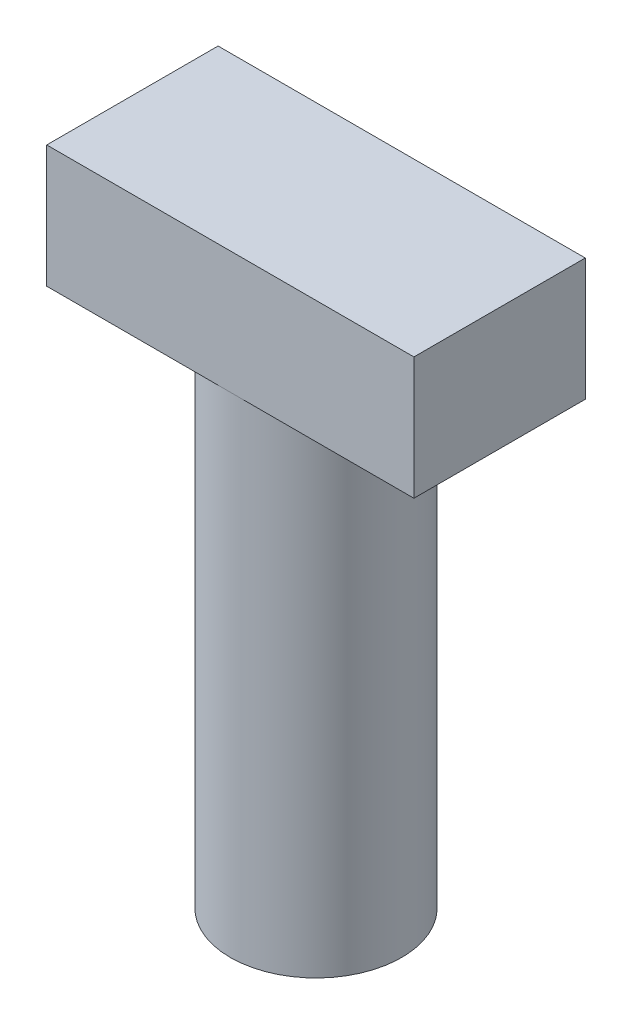
ISO-10303-21;
HEADER;
FILE_DESCRIPTION(('STEP AP214'),'2;1');
FILE_NAME('part.step','',(''),(''),'','','');
FILE_SCHEMA(('AUTOMOTIVE_DESIGN { 1 0 10303 214 1 1 1 1 }'));
ENDSEC;
DATA;
#1=APPLICATION_CONTEXT('core data for automotive mechanical design processes');
#2=APPLICATION_PROTOCOL_DEFINITION('international standard','automotive_design',2000,#1);
#3=PRODUCT_CONTEXT('',#1,'mechanical');
#4=PRODUCT('Part','Part','',(#3));
#5=PRODUCT_RELATED_PRODUCT_CATEGORY('part','',(#4));
#6=PRODUCT_DEFINITION_FORMATION('','',#4);
#7=PRODUCT_DEFINITION_CONTEXT('part definition',#1,'design');
#8=PRODUCT_DEFINITION('design','',#6,#7);
#9=PRODUCT_DEFINITION_SHAPE('','',#8);
#10=(LENGTH_UNIT() NAMED_UNIT(*) SI_UNIT(.MILLI.,.METRE.));
#11=(NAMED_UNIT(*) PLANE_ANGLE_UNIT() SI_UNIT($,.RADIAN.));
#12=(NAMED_UNIT(*) SI_UNIT($,.STERADIAN.) SOLID_ANGLE_UNIT());
#13=UNCERTAINTY_MEASURE_WITH_UNIT(LENGTH_MEASURE(1.E-05),#10,'distance_accuracy_value','');
#14=(GEOMETRIC_REPRESENTATION_CONTEXT(3) GLOBAL_UNCERTAINTY_ASSIGNED_CONTEXT((#13)) GLOBAL_UNIT_ASSIGNED_CONTEXT((#10,
#11,#12)) REPRESENTATION_CONTEXT('',''));
#15=CARTESIAN_POINT('',(0.,0.,0.));
#16=DIRECTION('',(0.,0.,1.));
#17=DIRECTION('',(1.,0.,0.));
#18=AXIS2_PLACEMENT_3D('',#15,#16,#17);
#19=CARTESIAN_POINT('',(0.,-10.,0.));
#20=DIRECTION('',(0.,1.,0.));
#21=DIRECTION('',(0.,0.,1.));
#22=AXIS2_PLACEMENT_3D('',#19,#20,#21);
#23=PLANE('',#22);
#24=CARTESIAN_POINT('',(0.,-10.,0.));
#25=DIRECTION('',(0.,-1.,0.));
#26=DIRECTION('',(0.,0.,-1.));
#27=AXIS2_PLACEMENT_3D('',#24,#25,#26);
#28=CIRCLE('',#27,7.);
#29=CARTESIAN_POINT('',(0.,-10.,-7.));
#30=VERTEX_POINT('',#29);
#31=CARTESIAN_POINT('',(0.,-10.,7.));
#32=VERTEX_POINT('',#31);
#33=EDGE_CURVE('E56',#30,#32,#28,.T.);
#34=ORIENTED_EDGE('',*,*,#33,.F.);
#35=DIRECTION('',(-1.,0.,0.));
#36=VECTOR('',#35,1.);
#37=CARTESIAN_POINT('',(-15.,-10.,-7.));
#38=LINE('',#37,#36);
#39=CARTESIAN_POINT('',(15.,-10.,-7.));
#40=VERTEX_POINT('',#39);
#41=EDGE_CURVE('E97',#40,#30,#38,.T.);
#42=ORIENTED_EDGE('',*,*,#41,.F.);
#43=DIRECTION('',(0.,0.,-1.));
#44=VECTOR('',#43,1.);
#45=CARTESIAN_POINT('',(15.,-10.,-7.));
#46=LINE('',#45,#44);
#47=CARTESIAN_POINT('',(15.,-10.,7.));
#48=VERTEX_POINT('',#47);
#49=EDGE_CURVE('E109',#48,#40,#46,.T.);
#50=ORIENTED_EDGE('',*,*,#49,.F.);
#51=DIRECTION('',(1.,0.,0.));
#52=VECTOR('',#51,1.);
#53=CARTESIAN_POINT('',(-15.,-10.,7.));
#54=LINE('',#53,#52);
#55=EDGE_CURVE('E111',#32,#48,#54,.T.);
#56=ORIENTED_EDGE('',*,*,#55,.F.);
#57=EDGE_LOOP('',(#34,#42,#50,#56));
#58=FACE_BOUND('',#57,.T.);
#59=ADVANCED_FACE('F45',(#58),#23,.F.);
#60=CARTESIAN_POINT('',(-15.,-10.,-7.));
#61=DIRECTION('',(-1.,0.,0.));
#62=DIRECTION('',(0.,0.,1.));
#63=AXIS2_PLACEMENT_3D('',#60,#61,#62);
#64=PLANE('',#63);
#65=DIRECTION('',(0.,0.,1.));
#66=VECTOR('',#65,1.);
#67=CARTESIAN_POINT('',(-15.,0.,-7.));
#68=LINE('',#67,#66);
#69=CARTESIAN_POINT('',(-15.,0.,-7.));
#70=VERTEX_POINT('',#69);
#71=CARTESIAN_POINT('',(-15.,0.,7.));
#72=VERTEX_POINT('',#71);
#73=EDGE_CURVE('E204',#70,#72,#68,.T.);
#74=ORIENTED_EDGE('',*,*,#73,.F.);
#75=DIRECTION('',(0.,1.,0.));
#76=VECTOR('',#75,1.);
#77=CARTESIAN_POINT('',(-15.,-10.,-7.));
#78=LINE('',#77,#76);
#79=CARTESIAN_POINT('',(-15.,-10.,-7.));
#80=VERTEX_POINT('',#79);
#81=EDGE_CURVE('E54',#80,#70,#78,.T.);
#82=ORIENTED_EDGE('',*,*,#81,.F.);
#83=DIRECTION('',(0.,0.,1.));
#84=VECTOR('',#83,1.);
#85=CARTESIAN_POINT('',(-15.,-10.,-7.));
#86=LINE('',#85,#84);
#87=CARTESIAN_POINT('',(-15.,-10.,7.));
#88=VERTEX_POINT('',#87);
#89=EDGE_CURVE('E108',#80,#88,#86,.T.);
#90=ORIENTED_EDGE('',*,*,#89,.T.);
#91=DIRECTION('',(0.,1.,0.));
#92=VECTOR('',#91,1.);
#93=CARTESIAN_POINT('',(-15.,-10.,7.));
#94=LINE('',#93,#92);
#95=EDGE_CURVE('E49',#88,#72,#94,.T.);
#96=ORIENTED_EDGE('',*,*,#95,.T.);
#97=EDGE_LOOP('',(#74,#82,#90,#96));
#98=FACE_BOUND('',#97,.T.);
#99=ADVANCED_FACE('F47',(#98),#64,.T.);
#100=CARTESIAN_POINT('',(-15.,-10.,-7.));
#101=DIRECTION('',(0.,0.,-1.));
#102=DIRECTION('',(-1.,0.,0.));
#103=AXIS2_PLACEMENT_3D('',#100,#101,#102);
#104=PLANE('',#103);
#105=DIRECTION('',(-1.,0.,0.));
#106=VECTOR('',#105,1.);
#107=CARTESIAN_POINT('',(-15.,0.,-7.));
#108=LINE('',#107,#106);
#109=CARTESIAN_POINT('',(15.,0.,-7.));
#110=VERTEX_POINT('',#109);
#111=EDGE_CURVE('E207',#110,#70,#108,.T.);
#112=ORIENTED_EDGE('',*,*,#111,.F.);
#113=DIRECTION('',(0.,1.,0.));
#114=VECTOR('',#113,1.);
#115=CARTESIAN_POINT('',(15.,-10.,-7.));
#116=LINE('',#115,#114);
#117=EDGE_CURVE('E99',#40,#110,#116,.T.);
#118=ORIENTED_EDGE('',*,*,#117,.F.);
#119=ORIENTED_EDGE('',*,*,#41,.T.);
#120=EDGE_CURVE('E69',#30,#80,#38,.T.);
#121=ORIENTED_EDGE('',*,*,#120,.T.);
#122=ORIENTED_EDGE('',*,*,#81,.T.);
#123=EDGE_LOOP('',(#112,#118,#119,#121,#122));
#124=FACE_BOUND('',#123,.T.);
#125=ADVANCED_FACE('F98',(#124),#104,.T.);
#126=CARTESIAN_POINT('',(15.,-10.,-7.));
#127=DIRECTION('',(1.,0.,0.));
#128=DIRECTION('',(0.,0.,-1.));
#129=AXIS2_PLACEMENT_3D('',#126,#127,#128);
#130=PLANE('',#129);
#131=DIRECTION('',(0.,0.,-1.));
#132=VECTOR('',#131,1.);
#133=CARTESIAN_POINT('',(15.,0.,-7.));
#134=LINE('',#133,#132);
#135=CARTESIAN_POINT('',(15.,0.,7.));
#136=VERTEX_POINT('',#135);
#137=EDGE_CURVE('E203',#136,#110,#134,.T.);
#138=ORIENTED_EDGE('',*,*,#137,.F.);
#139=DIRECTION('',(0.,1.,0.));
#140=VECTOR('',#139,1.);
#141=CARTESIAN_POINT('',(15.,-10.,7.));
#142=LINE('',#141,#140);
#143=EDGE_CURVE('E200',#48,#136,#142,.T.);
#144=ORIENTED_EDGE('',*,*,#143,.F.);
#145=ORIENTED_EDGE('',*,*,#49,.T.);
#146=ORIENTED_EDGE('',*,*,#117,.T.);
#147=EDGE_LOOP('',(#138,#144,#145,#146));
#148=FACE_BOUND('',#147,.T.);
#149=ADVANCED_FACE('F141',(#148),#130,.T.);
#150=CARTESIAN_POINT('',(-15.,-10.,7.));
#151=DIRECTION('',(0.,0.,1.));
#152=DIRECTION('',(1.,0.,0.));
#153=AXIS2_PLACEMENT_3D('',#150,#151,#152);
#154=PLANE('',#153);
#155=DIRECTION('',(1.,0.,0.));
#156=VECTOR('',#155,1.);
#157=CARTESIAN_POINT('',(-15.,0.,7.));
#158=LINE('',#157,#156);
#159=EDGE_CURVE('E197',#72,#136,#158,.T.);
#160=ORIENTED_EDGE('',*,*,#159,.F.);
#161=ORIENTED_EDGE('',*,*,#95,.F.);
#162=EDGE_CURVE('E217',#88,#32,#54,.T.);
#163=ORIENTED_EDGE('',*,*,#162,.T.);
#164=ORIENTED_EDGE('',*,*,#55,.T.);
#165=ORIENTED_EDGE('',*,*,#143,.T.);
#166=EDGE_LOOP('',(#160,#161,#163,#164,#165));
#167=FACE_BOUND('',#166,.T.);
#168=ADVANCED_FACE('F137',(#167),#154,.T.);
#169=EDGE_CURVE('E11',#32,#30,#28,.T.);
#170=ORIENTED_EDGE('',*,*,#169,.F.);
#171=ORIENTED_EDGE('',*,*,#162,.F.);
#172=ORIENTED_EDGE('',*,*,#89,.F.);
#173=ORIENTED_EDGE('',*,*,#120,.F.);
#174=EDGE_LOOP('',(#170,#171,#172,#173));
#175=FACE_BOUND('',#174,.T.);
#176=ADVANCED_FACE('F106',(#175),#23,.F.);
#177=CARTESIAN_POINT('',(0.,0.,0.));
#178=DIRECTION('',(0.,1.,0.));
#179=DIRECTION('',(0.,0.,1.));
#180=AXIS2_PLACEMENT_3D('',#177,#178,#179);
#181=PLANE('',#180);
#182=ORIENTED_EDGE('',*,*,#73,.T.);
#183=ORIENTED_EDGE('',*,*,#159,.T.);
#184=ORIENTED_EDGE('',*,*,#137,.T.);
#185=ORIENTED_EDGE('',*,*,#111,.T.);
#186=EDGE_LOOP('',(#182,#183,#184,#185));
#187=FACE_BOUND('',#186,.T.);
#188=ADVANCED_FACE('F117',(#187),#181,.T.);
#189=CARTESIAN_POINT('',(0.,-50.,0.));
#190=DIRECTION('',(0.,1.,0.));
#191=DIRECTION('',(0.,0.,1.));
#192=AXIS2_PLACEMENT_3D('',#189,#190,#191);
#193=CYLINDRICAL_SURFACE('',#192,7.);
#194=CARTESIAN_POINT('',(0.,-50.,0.));
#195=DIRECTION('',(0.,-1.,0.));
#196=DIRECTION('',(0.,0.,-1.));
#197=AXIS2_PLACEMENT_3D('',#194,#195,#196);
#198=CIRCLE('',#197,7.);
#199=CARTESIAN_POINT('',(0.,-50.,-7.));
#200=VERTEX_POINT('',#199);
#201=EDGE_CURVE('E113',#200,#200,#198,.T.);
#202=ORIENTED_EDGE('',*,*,#201,.F.);
#203=EDGE_LOOP('',(#202));
#204=FACE_BOUND('',#203,.T.);
#205=ORIENTED_EDGE('',*,*,#33,.T.);
#206=ORIENTED_EDGE('',*,*,#169,.T.);
#207=EDGE_LOOP('',(#205,#206));
#208=FACE_BOUND('',#207,.T.);
#209=ADVANCED_FACE('F114',(#204,#208),#193,.T.);
#210=CARTESIAN_POINT('',(0.,-50.,0.));
#211=DIRECTION('',(0.,-1.,0.));
#212=DIRECTION('',(0.,0.,-1.));
#213=AXIS2_PLACEMENT_3D('',#210,#211,#212);
#214=PLANE('',#213);
#215=ORIENTED_EDGE('',*,*,#201,.T.);
#216=EDGE_LOOP('',(#215));
#217=FACE_BOUND('',#216,.T.);
#218=ADVANCED_FACE('F116',(#217),#214,.T.);
#219=CLOSED_SHELL('',(#59,#99,#125,#149,#168,#176,#188,#209,#218));
#220=MANIFOLD_SOLID_BREP('B2',#219);
#221=ADVANCED_BREP_SHAPE_REPRESENTATION('',(#18,#220),#14);
#222=SHAPE_DEFINITION_REPRESENTATION(#9,#221);
ENDSEC;
END-ISO-10303-21;
